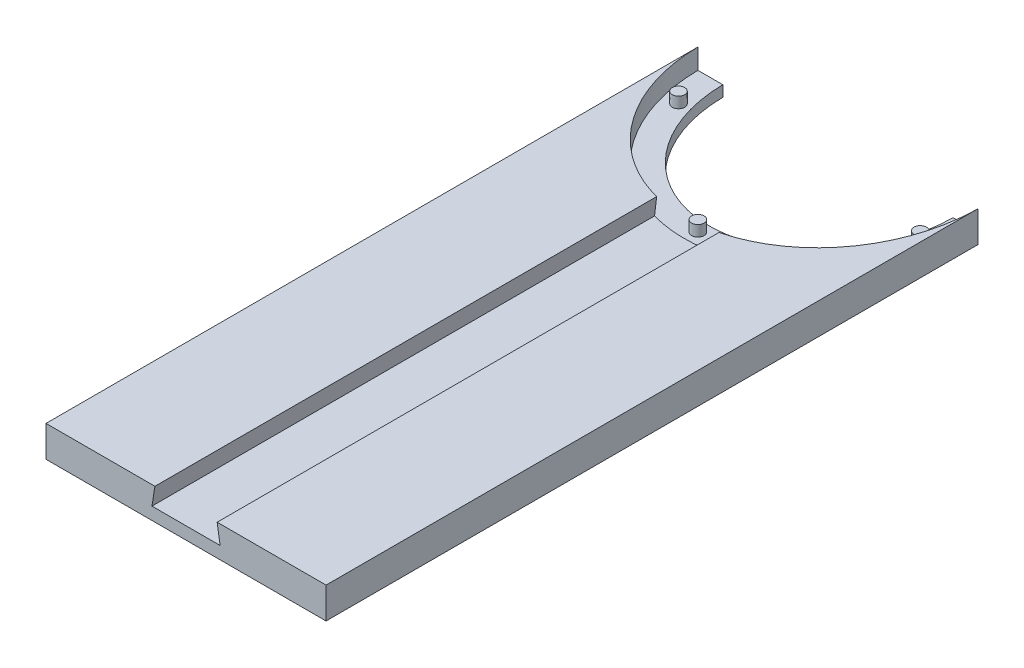
ISO-10303-21;
HEADER;
FILE_DESCRIPTION(('STEP AP214'),'2;1');
FILE_NAME('part.step','',(''),(''),'','','');
FILE_SCHEMA(('AUTOMOTIVE_DESIGN { 1 0 10303 214 1 1 1 1 }'));
ENDSEC;
DATA;
#1=APPLICATION_CONTEXT('core data for automotive mechanical design processes');
#2=APPLICATION_PROTOCOL_DEFINITION('international standard','automotive_design',2000,#1);
#3=PRODUCT_CONTEXT('',#1,'mechanical');
#4=PRODUCT('Part','Part','',(#3));
#5=PRODUCT_RELATED_PRODUCT_CATEGORY('part','',(#4));
#6=PRODUCT_DEFINITION_FORMATION('','',#4);
#7=PRODUCT_DEFINITION_CONTEXT('part definition',#1,'design');
#8=PRODUCT_DEFINITION('design','',#6,#7);
#9=PRODUCT_DEFINITION_SHAPE('','',#8);
#10=(LENGTH_UNIT() NAMED_UNIT(*) SI_UNIT(.MILLI.,.METRE.));
#11=(NAMED_UNIT(*) PLANE_ANGLE_UNIT() SI_UNIT($,.RADIAN.));
#12=(NAMED_UNIT(*) SI_UNIT($,.STERADIAN.) SOLID_ANGLE_UNIT());
#13=UNCERTAINTY_MEASURE_WITH_UNIT(LENGTH_MEASURE(1.E-05),#10,'distance_accuracy_value','');
#14=(GEOMETRIC_REPRESENTATION_CONTEXT(3) GLOBAL_UNCERTAINTY_ASSIGNED_CONTEXT((#13)) GLOBAL_UNIT_ASSIGNED_CONTEXT((#10,
#11,#12)) REPRESENTATION_CONTEXT('',''));
#15=CARTESIAN_POINT('',(0.,0.,0.));
#16=DIRECTION('',(0.,0.,1.));
#17=DIRECTION('',(1.,0.,0.));
#18=AXIS2_PLACEMENT_3D('',#15,#16,#17);
#19=CARTESIAN_POINT('',(0.,10.,0.));
#20=DIRECTION('',(0.,1.,0.));
#21=DIRECTION('',(0.,0.,1.));
#22=AXIS2_PLACEMENT_3D('',#19,#20,#21);
#23=PLANE('',#22);
#24=CARTESIAN_POINT('',(0.,10.,0.));
#25=DIRECTION('',(0.,1.,0.));
#26=DIRECTION('',(0.,0.,1.));
#27=AXIS2_PLACEMENT_3D('',#24,#25,#26);
#28=ELLIPSE('',#27,50.,45.);
#29=CARTESIAN_POINT('',(9.99999999999997,10.,48.7498021521785));
#30=VERTEX_POINT('',#29);
#31=CARTESIAN_POINT('',(44.9977499437472,10.,0.5));
#32=VERTEX_POINT('',#31);
#33=EDGE_CURVE('E72',#30,#32,#28,.T.);
#34=ORIENTED_EDGE('',*,*,#33,.F.);
#35=DIRECTION('',(0.,0.,1.));
#36=VECTOR('',#35,1.);
#37=CARTESIAN_POINT('',(9.99999999999998,10.,0.));
#38=LINE('',#37,#36);
#39=CARTESIAN_POINT('',(9.99999999999998,10.,210.));
#40=VERTEX_POINT('',#39);
#41=EDGE_CURVE('E56',#30,#40,#38,.T.);
#42=ORIENTED_EDGE('',*,*,#41,.T.);
#43=DIRECTION('',(1.,0.,0.));
#44=VECTOR('',#43,1.);
#45=CARTESIAN_POINT('',(0.,10.,210.));
#46=LINE('',#45,#44);
#47=CARTESIAN_POINT('',(45.,10.,210.));
#48=VERTEX_POINT('',#47);
#49=EDGE_CURVE('E116',#40,#48,#46,.T.);
#50=ORIENTED_EDGE('',*,*,#49,.T.);
#51=DIRECTION('',(0.,0.,-1.));
#52=VECTOR('',#51,1.);
#53=CARTESIAN_POINT('',(45.,10.,0.));
#54=LINE('',#53,#52);
#55=CARTESIAN_POINT('',(45.,10.,0.5));
#56=VERTEX_POINT('',#55);
#57=EDGE_CURVE('E120',#48,#56,#54,.T.);
#58=ORIENTED_EDGE('',*,*,#57,.T.);
#59=DIRECTION('',(1.,0.,0.));
#60=VECTOR('',#59,1.);
#61=CARTESIAN_POINT('',(0.,10.,0.5));
#62=LINE('',#61,#60);
#63=EDGE_CURVE('E139',#32,#56,#62,.T.);
#64=ORIENTED_EDGE('',*,*,#63,.F.);
#65=EDGE_LOOP('',(#34,#42,#50,#58,#64));
#66=FACE_BOUND('',#65,.T.);
#67=ADVANCED_FACE('F45',(#66),#23,.T.);
#68=DIRECTION('',(0.,-1.,0.));
#69=VECTOR('',#68,1.);
#70=SURFACE_OF_LINEAR_EXTRUSION('',#28,#69);
#71=CARTESIAN_POINT('',(-10.9503066419472,4.,48.4970507496741));
#72=CARTESIAN_POINT('',(-10.7919353279563,4.99991712359095,48.5411927180159));
#73=CARTESIAN_POINT('',(-10.6335574507986,5.99987568538642,48.5843263190622));
#74=CARTESIAN_POINT('',(-10.3167885701496,7.99987568538642,48.6685767865637));
#75=CARTESIAN_POINT('',(-10.1583975666582,8.99991712359095,48.7096936530189));
#76=CARTESIAN_POINT('',(-10.,10.,48.7498021521785));
#77=B_SPLINE_CURVE_WITH_KNOTS('',3,(#71,#72,#73,#74,#75,#76),.UNSPECIFIED.,.F.,.F.,(4,2,4),(0.,
3.04002478006059,6.08004956012118),.UNSPECIFIED.);
#78=CARTESIAN_POINT('',(-10.9503066419472,4.,48.497050749674));
#79=VERTEX_POINT('',#78);
#80=CARTESIAN_POINT('',(-10.,10.,48.7498021521785));
#81=VERTEX_POINT('',#80);
#82=EDGE_CURVE('E246',#79,#81,#77,.T.);
#83=ORIENTED_EDGE('',*,*,#82,.F.);
#84=CARTESIAN_POINT('',(0.,4.,0.));
#85=DIRECTION('',(0.,1.,0.));
#86=DIRECTION('',(0.,0.,1.));
#87=AXIS2_PLACEMENT_3D('',#84,#85,#86);
#88=ELLIPSE('',#87,50.,45.);
#89=CARTESIAN_POINT('',(10.9503066419472,4.00000000000005,48.497050749674));
#90=VERTEX_POINT('',#89);
#91=EDGE_CURVE('E249',#90,#79,#88,.F.);
#92=ORIENTED_EDGE('',*,*,#91,.F.);
#93=CARTESIAN_POINT('',(10.9503066419472,4.00000000000005,48.497050749674));
#94=CARTESIAN_POINT('',(10.7919353279564,4.99991712359099,48.5411927180159));
#95=CARTESIAN_POINT('',(10.6335574507987,5.99987568538645,48.5843263190622));
#96=CARTESIAN_POINT('',(10.3167885701496,7.99987568538644,48.6685767865637));
#97=CARTESIAN_POINT('',(10.1583975666582,8.99991712359095,48.7096936530189));
#98=CARTESIAN_POINT('',(9.99999999999998,10.,48.7498021521785));
#99=B_SPLINE_CURVE_WITH_KNOTS('',3,(#93,#94,#95,#96,#97,#98),.UNSPECIFIED.,.F.,.F.,(4,2,4),(0.,
3.04002478006057,6.08004956012115),.UNSPECIFIED.);
#100=EDGE_CURVE('E258',#90,#30,#99,.T.);
#101=ORIENTED_EDGE('',*,*,#100,.T.);
#102=ORIENTED_EDGE('',*,*,#33,.T.);
#103=DIRECTION('',(0.,-1.,0.));
#104=VECTOR('',#103,1.);
#105=CARTESIAN_POINT('',(44.9977499437472,10.,0.5));
#106=LINE('',#105,#104);
#107=CARTESIAN_POINT('',(44.9977499437472,3.5,0.5));
#108=VERTEX_POINT('',#107);
#109=EDGE_CURVE('E143',#32,#108,#106,.T.);
#110=ORIENTED_EDGE('',*,*,#109,.T.);
#111=CARTESIAN_POINT('',(0.,3.5,0.));
#112=DIRECTION('',(0.,1.,0.));
#113=DIRECTION('',(0.,0.,1.));
#114=AXIS2_PLACEMENT_3D('',#111,#112,#113);
#115=ELLIPSE('',#114,50.,45.);
#116=CARTESIAN_POINT('',(-44.9977499437472,3.5,0.5));
#117=VERTEX_POINT('',#116);
#118=EDGE_CURVE('E171',#117,#108,#115,.T.);
#119=ORIENTED_EDGE('',*,*,#118,.F.);
#120=DIRECTION('',(0.,-1.,0.));
#121=VECTOR('',#120,1.);
#122=CARTESIAN_POINT('',(-44.9977499437472,10.,0.5));
#123=LINE('',#122,#121);
#124=CARTESIAN_POINT('',(-44.9977499437472,10.,0.5));
#125=VERTEX_POINT('',#124);
#126=EDGE_CURVE('E103',#125,#117,#123,.T.);
#127=ORIENTED_EDGE('',*,*,#126,.F.);
#128=EDGE_CURVE('E251',#125,#81,#28,.T.);
#129=ORIENTED_EDGE('',*,*,#128,.T.);
#130=EDGE_LOOP('',(#83,#92,#101,#102,#110,#119,#127,#129));
#131=FACE_BOUND('',#130,.T.);
#132=ADVANCED_FACE('F47',(#131),#70,.T.);
#133=CARTESIAN_POINT('',(0.,10.,0.5));
#134=DIRECTION('',(0.,0.,-1.));
#135=DIRECTION('',(-1.,0.,0.));
#136=AXIS2_PLACEMENT_3D('',#133,#134,#135);
#137=PLANE('',#136);
#138=DIRECTION('',(1.,0.,0.));
#139=VECTOR('',#138,1.);
#140=CARTESIAN_POINT('',(0.,0.,0.5));
#141=LINE('',#140,#139);
#142=CARTESIAN_POINT('',(-45.,0.,0.5));
#143=VERTEX_POINT('',#142);
#144=CARTESIAN_POINT('',(-36.9973577680352,0.,0.5));
#145=VERTEX_POINT('',#144);
#146=EDGE_CURVE('E149',#143,#145,#141,.T.);
#147=ORIENTED_EDGE('',*,*,#146,.F.);
#148=DIRECTION('',(0.,-1.,0.));
#149=VECTOR('',#148,1.);
#150=CARTESIAN_POINT('',(-45.,10.,0.5));
#151=LINE('',#150,#149);
#152=CARTESIAN_POINT('',(-45.,10.,0.5));
#153=VERTEX_POINT('',#152);
#154=EDGE_CURVE('E335',#153,#143,#151,.T.);
#155=ORIENTED_EDGE('',*,*,#154,.F.);
#156=EDGE_CURVE('E145',#153,#125,#62,.T.);
#157=ORIENTED_EDGE('',*,*,#156,.T.);
#158=ORIENTED_EDGE('',*,*,#126,.T.);
#159=DIRECTION('',(1.,0.,0.));
#160=VECTOR('',#159,1.);
#161=CARTESIAN_POINT('',(0.,3.5,0.5));
#162=LINE('',#161,#160);
#163=CARTESIAN_POINT('',(-36.9973577680352,3.5,0.5));
#164=VERTEX_POINT('',#163);
#165=EDGE_CURVE('E176',#117,#164,#162,.T.);
#166=ORIENTED_EDGE('',*,*,#165,.T.);
#167=DIRECTION('',(0.,-1.,0.));
#168=VECTOR('',#167,1.);
#169=CARTESIAN_POINT('',(-36.9973577680352,3.5,0.5));
#170=LINE('',#169,#168);
#171=EDGE_CURVE('E175',#164,#145,#170,.T.);
#172=ORIENTED_EDGE('',*,*,#171,.T.);
#173=EDGE_LOOP('',(#147,#155,#157,#158,#166,#172));
#174=FACE_BOUND('',#173,.T.);
#175=ADVANCED_FACE('F224',(#174),#137,.T.);
#176=CARTESIAN_POINT('',(-45.,10.,0.));
#177=DIRECTION('',(-1.,0.,0.));
#178=DIRECTION('',(0.,0.,1.));
#179=AXIS2_PLACEMENT_3D('',#176,#177,#178);
#180=PLANE('',#179);
#181=DIRECTION('',(0.,0.,-1.));
#182=VECTOR('',#181,1.);
#183=CARTESIAN_POINT('',(-45.,0.,0.));
#184=LINE('',#183,#182);
#185=CARTESIAN_POINT('',(-45.,0.,210.));
#186=VERTEX_POINT('',#185);
#187=EDGE_CURVE('E153',#186,#143,#184,.T.);
#188=ORIENTED_EDGE('',*,*,#187,.F.);
#189=DIRECTION('',(0.,-1.,0.));
#190=VECTOR('',#189,1.);
#191=CARTESIAN_POINT('',(-45.,10.,210.));
#192=LINE('',#191,#190);
#193=CARTESIAN_POINT('',(-45.,10.,210.));
#194=VERTEX_POINT('',#193);
#195=EDGE_CURVE('E135',#194,#186,#192,.T.);
#196=ORIENTED_EDGE('',*,*,#195,.F.);
#197=DIRECTION('',(0.,0.,-1.));
#198=VECTOR('',#197,1.);
#199=CARTESIAN_POINT('',(-45.,10.,0.));
#200=LINE('',#199,#198);
#201=EDGE_CURVE('E124',#194,#153,#200,.T.);
#202=ORIENTED_EDGE('',*,*,#201,.T.);
#203=ORIENTED_EDGE('',*,*,#154,.T.);
#204=EDGE_LOOP('',(#188,#196,#202,#203));
#205=FACE_BOUND('',#204,.T.);
#206=ADVANCED_FACE('F228',(#205),#180,.T.);
#207=CARTESIAN_POINT('',(0.,10.,210.));
#208=DIRECTION('',(0.,0.,-1.));
#209=DIRECTION('',(-1.,0.,0.));
#210=AXIS2_PLACEMENT_3D('',#207,#208,#209);
#211=PLANE('',#210);
#212=DIRECTION('',(1.,0.,0.));
#213=VECTOR('',#212,1.);
#214=CARTESIAN_POINT('',(-10.9503066419472,4.,210.));
#215=LINE('',#214,#213);
#216=CARTESIAN_POINT('',(-10.9503066419472,4.,210.));
#217=VERTEX_POINT('',#216);
#218=CARTESIAN_POINT('',(10.9503066419472,4.00000000000005,210.));
#219=VERTEX_POINT('',#218);
#220=EDGE_CURVE('E380',#217,#219,#215,.T.);
#221=ORIENTED_EDGE('',*,*,#220,.F.);
#222=DIRECTION('',(-0.156434465040235,-0.987688340595137,0.));
#223=VECTOR('',#222,1.);
#224=CARTESIAN_POINT('',(-10.,10.,210.));
#225=LINE('',#224,#223);
#226=CARTESIAN_POINT('',(-10.,10.,210.));
#227=VERTEX_POINT('',#226);
#228=EDGE_CURVE('E382',#227,#217,#225,.T.);
#229=ORIENTED_EDGE('',*,*,#228,.F.);
#230=EDGE_CURVE('E123',#194,#227,#46,.T.);
#231=ORIENTED_EDGE('',*,*,#230,.F.);
#232=ORIENTED_EDGE('',*,*,#195,.T.);
#233=DIRECTION('',(1.,0.,0.));
#234=VECTOR('',#233,1.);
#235=CARTESIAN_POINT('',(0.,0.,210.));
#236=LINE('',#235,#234);
#237=CARTESIAN_POINT('',(45.,0.,210.));
#238=VERTEX_POINT('',#237);
#239=EDGE_CURVE('E131',#186,#238,#236,.T.);
#240=ORIENTED_EDGE('',*,*,#239,.T.);
#241=DIRECTION('',(0.,-1.,0.));
#242=VECTOR('',#241,1.);
#243=CARTESIAN_POINT('',(45.,10.,210.));
#244=LINE('',#243,#242);
#245=EDGE_CURVE('E127',#48,#238,#244,.T.);
#246=ORIENTED_EDGE('',*,*,#245,.F.);
#247=ORIENTED_EDGE('',*,*,#49,.F.);
#248=DIRECTION('',(0.156434465040239,-0.987688340595136,0.));
#249=VECTOR('',#248,1.);
#250=CARTESIAN_POINT('',(9.99999999999997,10.,210.));
#251=LINE('',#250,#249);
#252=EDGE_CURVE('E63',#40,#219,#251,.T.);
#253=ORIENTED_EDGE('',*,*,#252,.T.);
#254=EDGE_LOOP('',(#221,#229,#231,#232,#240,#246,#247,#253));
#255=FACE_BOUND('',#254,.T.);
#256=ADVANCED_FACE('F129',(#255),#211,.F.);
#257=CARTESIAN_POINT('',(45.,10.,0.));
#258=DIRECTION('',(-1.,0.,0.));
#259=DIRECTION('',(0.,0.,1.));
#260=AXIS2_PLACEMENT_3D('',#257,#258,#259);
#261=PLANE('',#260);
#262=DIRECTION('',(0.,0.,-1.));
#263=VECTOR('',#262,1.);
#264=CARTESIAN_POINT('',(45.,0.,0.));
#265=LINE('',#264,#263);
#266=CARTESIAN_POINT('',(45.,0.,0.5));
#267=VERTEX_POINT('',#266);
#268=EDGE_CURVE('E161',#238,#267,#265,.T.);
#269=ORIENTED_EDGE('',*,*,#268,.T.);
#270=DIRECTION('',(0.,-1.,0.));
#271=VECTOR('',#270,1.);
#272=CARTESIAN_POINT('',(45.,10.,0.5));
#273=LINE('',#272,#271);
#274=EDGE_CURVE('E95',#56,#267,#273,.T.);
#275=ORIENTED_EDGE('',*,*,#274,.F.);
#276=ORIENTED_EDGE('',*,*,#57,.F.);
#277=ORIENTED_EDGE('',*,*,#245,.T.);
#278=EDGE_LOOP('',(#269,#275,#276,#277));
#279=FACE_BOUND('',#278,.T.);
#280=ADVANCED_FACE('F137',(#279),#261,.F.);
#281=CARTESIAN_POINT('',(36.9973577680352,0.,0.5));
#282=VERTEX_POINT('',#281);
#283=EDGE_CURVE('E155',#282,#267,#141,.T.);
#284=ORIENTED_EDGE('',*,*,#283,.F.);
#285=DIRECTION('',(0.,-1.,0.));
#286=VECTOR('',#285,1.);
#287=CARTESIAN_POINT('',(36.9973577680352,3.5,0.5));
#288=LINE('',#287,#286);
#289=CARTESIAN_POINT('',(36.9973577680352,3.5,0.5));
#290=VERTEX_POINT('',#289);
#291=EDGE_CURVE('E154',#290,#282,#288,.T.);
#292=ORIENTED_EDGE('',*,*,#291,.F.);
#293=EDGE_CURVE('E184',#290,#108,#162,.T.);
#294=ORIENTED_EDGE('',*,*,#293,.T.);
#295=ORIENTED_EDGE('',*,*,#109,.F.);
#296=ORIENTED_EDGE('',*,*,#63,.T.);
#297=ORIENTED_EDGE('',*,*,#274,.T.);
#298=EDGE_LOOP('',(#284,#292,#294,#295,#296,#297));
#299=FACE_BOUND('',#298,.T.);
#300=ADVANCED_FACE('F217',(#299),#137,.T.);
#301=DIRECTION('',(0.,0.,1.));
#302=VECTOR('',#301,1.);
#303=CARTESIAN_POINT('',(-10.,10.,0.));
#304=LINE('',#303,#302);
#305=EDGE_CURVE('E11',#81,#227,#304,.T.);
#306=ORIENTED_EDGE('',*,*,#305,.F.);
#307=ORIENTED_EDGE('',*,*,#128,.F.);
#308=ORIENTED_EDGE('',*,*,#156,.F.);
#309=ORIENTED_EDGE('',*,*,#201,.F.);
#310=ORIENTED_EDGE('',*,*,#230,.T.);
#311=EDGE_LOOP('',(#306,#307,#308,#309,#310));
#312=FACE_BOUND('',#311,.T.);
#313=ADVANCED_FACE('F214',(#312),#23,.T.);
#314=CARTESIAN_POINT('',(0.,0.,0.));
#315=DIRECTION('',(0.,1.,0.));
#316=DIRECTION('',(0.,0.,1.));
#317=AXIS2_PLACEMENT_3D('',#314,#315,#316);
#318=PLANE('',#317);
#319=ORIENTED_EDGE('',*,*,#146,.T.);
#320=CARTESIAN_POINT('',(0.,0.,-42.));
#321=CARTESIAN_POINT('',(-4.93138164351082,0.,-42.));
#322=CARTESIAN_POINT('',(-14.7941449305325,0.,-39.7237391442364));
#323=CARTESIAN_POINT('',(-27.0896008441229,0.,-30.2004855000218));
#324=CARTESIAN_POINT('',(-35.1368792596779,0.,-16.2564691599312));
#325=CARTESIAN_POINT('',(-37.931560370161,0.,0.));
#326=CARTESIAN_POINT('',(-35.1368792596779,0.,16.2564691599312));
#327=CARTESIAN_POINT('',(-27.0896008441229,0.,30.2004855000218));
#328=CARTESIAN_POINT('',(-14.7941449305325,0.,39.7237391442364));
#329=CARTESIAN_POINT('',(0.,0.,43.1381304278818));
#330=CARTESIAN_POINT('',(14.7941449305325,0.,39.7237391442364));
#331=CARTESIAN_POINT('',(27.0896008441229,0.,30.2004855000219));
#332=CARTESIAN_POINT('',(35.1368792596779,0.,16.2564691599312));
#333=CARTESIAN_POINT('',(37.931560370161,0.,0.));
#334=CARTESIAN_POINT('',(35.1368792596779,0.,-16.2564691599312));
#335=CARTESIAN_POINT('',(27.0896008441229,0.,-30.2004855000218));
#336=CARTESIAN_POINT('',(14.7941449305325,0.,-39.7237391442364));
#337=CARTESIAN_POINT('',(4.93138164351083,0.,-42.));
#338=CARTESIAN_POINT('',(0.,0.,-42.));
#339=B_SPLINE_CURVE_WITH_KNOTS('',3,(#320,#321,#322,#323,#324,#325,#326,#327,#328,#329,#330,
#331,#332,#333,#334,#335,#336,#337,#338),.UNSPECIFIED.,.T.,.F.,(4,1,1,1,1,1,1,1,1,1,1,1,1,1,1,1,
4),(0.,0.392699081698724,0.785398163397448,1.17809724509617,1.5707963267949,1.96349540849362,
2.35619449019234,2.74889357189107,3.14159265358979,3.53429173528852,3.92699081698724,
4.31968989868597,4.71238898038469,5.10508806208341,5.49778714378214,5.89048622548086,
6.28318530717959),.UNSPECIFIED.);
#340=EDGE_CURVE('E198',#145,#282,#339,.T.);
#341=ORIENTED_EDGE('',*,*,#340,.T.);
#342=ORIENTED_EDGE('',*,*,#283,.T.);
#343=ORIENTED_EDGE('',*,*,#268,.F.);
#344=ORIENTED_EDGE('',*,*,#239,.F.);
#345=ORIENTED_EDGE('',*,*,#187,.T.);
#346=EDGE_LOOP('',(#319,#341,#342,#343,#344,#345));
#347=FACE_BOUND('',#346,.T.);
#348=ADVANCED_FACE('F211',(#347),#318,.F.);
#349=CARTESIAN_POINT('',(0.,3.5,-42.));
#350=CARTESIAN_POINT('',(-4.93138164351082,3.5,-42.));
#351=CARTESIAN_POINT('',(-14.7941449305325,3.5,-39.7237391442364));
#352=CARTESIAN_POINT('',(-27.0896008441229,3.5,-30.2004855000218));
#353=CARTESIAN_POINT('',(-35.1368792596779,3.5,-16.2564691599312));
#354=CARTESIAN_POINT('',(-37.931560370161,3.5,0.));
#355=CARTESIAN_POINT('',(-35.1368792596779,3.5,16.2564691599312));
#356=CARTESIAN_POINT('',(-27.0896008441229,3.5,30.2004855000218));
#357=CARTESIAN_POINT('',(-14.7941449305325,3.5,39.7237391442364));
#358=CARTESIAN_POINT('',(0.,3.5,43.1381304278818));
#359=CARTESIAN_POINT('',(14.7941449305325,3.5,39.7237391442364));
#360=CARTESIAN_POINT('',(27.0896008441229,3.5,30.2004855000219));
#361=CARTESIAN_POINT('',(35.1368792596779,3.5,16.2564691599312));
#362=CARTESIAN_POINT('',(37.931560370161,3.5,0.));
#363=CARTESIAN_POINT('',(35.1368792596779,3.5,-16.2564691599312));
#364=CARTESIAN_POINT('',(27.0896008441229,3.5,-30.2004855000218));
#365=CARTESIAN_POINT('',(14.7941449305325,3.5,-39.7237391442364));
#366=CARTESIAN_POINT('',(4.93138164351083,3.5,-42.));
#367=CARTESIAN_POINT('',(0.,3.5,-42.));
#368=B_SPLINE_CURVE_WITH_KNOTS('',3,(#349,#350,#351,#352,#353,#354,#355,#356,#357,#358,#359,
#360,#361,#362,#363,#364,#365,#366,#367),.UNSPECIFIED.,.T.,.F.,(4,1,1,1,1,1,1,1,1,1,1,1,1,1,1,1,
4),(0.,0.392699081698724,0.785398163397448,1.17809724509617,1.5707963267949,1.96349540849362,
2.35619449019234,2.74889357189107,3.14159265358979,3.53429173528852,3.92699081698724,
4.31968989868597,4.71238898038469,5.10508806208341,5.49778714378214,5.89048622548086,
6.28318530717959),.UNSPECIFIED.);
#369=DIRECTION('',(0.,-1.,0.));
#370=VECTOR('',#369,1.);
#371=SURFACE_OF_LINEAR_EXTRUSION('',#368,#370);
#372=ORIENTED_EDGE('',*,*,#340,.F.);
#373=ORIENTED_EDGE('',*,*,#171,.F.);
#374=EDGE_CURVE('E183',#164,#290,#368,.T.);
#375=ORIENTED_EDGE('',*,*,#374,.T.);
#376=ORIENTED_EDGE('',*,*,#291,.T.);
#377=EDGE_LOOP('',(#372,#373,#375,#376));
#378=FACE_BOUND('',#377,.T.);
#379=ADVANCED_FACE('F206',(#378),#371,.T.);
#380=CARTESIAN_POINT('',(0.,3.5,0.));
#381=DIRECTION('',(0.,1.,0.));
#382=DIRECTION('',(0.,0.,1.));
#383=AXIS2_PLACEMENT_3D('',#380,#381,#382);
#384=PLANE('',#383);
#385=CARTESIAN_POINT('',(38.8404838015386,3.5,12.9089643673815));
#386=DIRECTION('',(0.,1.,0.));
#387=DIRECTION('',(0.,0.,1.));
#388=AXIS2_PLACEMENT_3D('',#385,#386,#387);
#389=CIRCLE('',#388,2.);
#390=CARTESIAN_POINT('',(38.8404838015386,3.5,14.9089643673815));
#391=VERTEX_POINT('',#390);
#392=EDGE_CURVE('E329',#391,#391,#389,.T.);
#393=ORIENTED_EDGE('',*,*,#392,.F.);
#394=EDGE_LOOP('',(#393));
#395=FACE_BOUND('',#394,.T.);
#396=CARTESIAN_POINT('',(0.,3.5,45.5));
#397=DIRECTION('',(0.,1.,0.));
#398=DIRECTION('',(0.,0.,1.));
#399=AXIS2_PLACEMENT_3D('',#396,#397,#398);
#400=CIRCLE('',#399,2.);
#401=CARTESIAN_POINT('',(0.,3.5,47.5));
#402=VERTEX_POINT('',#401);
#403=EDGE_CURVE('E318',#402,#402,#400,.F.);
#404=ORIENTED_EDGE('',*,*,#403,.T.);
#405=EDGE_LOOP('',(#404));
#406=FACE_BOUND('',#405,.T.);
#407=CARTESIAN_POINT('',(-38.8404838015386,3.5,12.9089643673815));
#408=DIRECTION('',(0.,1.,0.));
#409=DIRECTION('',(0.,0.,1.));
#410=AXIS2_PLACEMENT_3D('',#407,#408,#409);
#411=CIRCLE('',#410,2.);
#412=CARTESIAN_POINT('',(-38.8404838015386,3.5,14.9089643673815));
#413=VERTEX_POINT('',#412);
#414=EDGE_CURVE('E314',#413,#413,#411,.F.);
#415=ORIENTED_EDGE('',*,*,#414,.T.);
#416=EDGE_LOOP('',(#415));
#417=FACE_BOUND('',#416,.T.);
#418=ORIENTED_EDGE('',*,*,#293,.F.);
#419=ORIENTED_EDGE('',*,*,#374,.F.);
#420=ORIENTED_EDGE('',*,*,#165,.F.);
#421=ORIENTED_EDGE('',*,*,#118,.T.);
#422=EDGE_LOOP('',(#418,#419,#420,#421));
#423=FACE_BOUND('',#422,.T.);
#424=ADVANCED_FACE('F210',(#395,#406,#417,#423),#384,.T.);
#425=CARTESIAN_POINT('',(-38.8404838015386,7.,12.9089643673815));
#426=DIRECTION('',(0.,-1.,0.));
#427=DIRECTION('',(0.,0.,-1.));
#428=AXIS2_PLACEMENT_3D('',#425,#426,#427);
#429=CYLINDRICAL_SURFACE('',#428,2.);
#430=ORIENTED_EDGE('',*,*,#414,.F.);
#431=EDGE_LOOP('',(#430));
#432=FACE_BOUND('',#431,.T.);
#433=CARTESIAN_POINT('',(-38.8404838015386,7.,12.9089643673815));
#434=DIRECTION('',(0.,1.,0.));
#435=DIRECTION('',(0.,0.,1.));
#436=AXIS2_PLACEMENT_3D('',#433,#434,#435);
#437=CIRCLE('',#436,2.);
#438=CARTESIAN_POINT('',(-38.8404838015386,7.,14.9089643673815));
#439=VERTEX_POINT('',#438);
#440=EDGE_CURVE('E189',#439,#439,#437,.T.);
#441=ORIENTED_EDGE('',*,*,#440,.F.);
#442=EDGE_LOOP('',(#441));
#443=FACE_BOUND('',#442,.T.);
#444=ADVANCED_FACE('F303',(#432,#443),#429,.T.);
#445=CARTESIAN_POINT('',(-38.8404838015386,7.,12.9089643673815));
#446=DIRECTION('',(0.,1.,0.));
#447=DIRECTION('',(0.,0.,1.));
#448=AXIS2_PLACEMENT_3D('',#445,#446,#447);
#449=PLANE('',#448);
#450=ORIENTED_EDGE('',*,*,#440,.T.);
#451=EDGE_LOOP('',(#450));
#452=FACE_BOUND('',#451,.T.);
#453=ADVANCED_FACE('F297',(#452),#449,.T.);
#454=CARTESIAN_POINT('',(0.,7.,45.5));
#455=DIRECTION('',(0.,-1.,0.));
#456=DIRECTION('',(0.,0.,-1.));
#457=AXIS2_PLACEMENT_3D('',#454,#455,#456);
#458=CYLINDRICAL_SURFACE('',#457,2.);
#459=ORIENTED_EDGE('',*,*,#403,.F.);
#460=EDGE_LOOP('',(#459));
#461=FACE_BOUND('',#460,.T.);
#462=CARTESIAN_POINT('',(0.,7.,45.5));
#463=DIRECTION('',(0.,1.,0.));
#464=DIRECTION('',(0.,0.,1.));
#465=AXIS2_PLACEMENT_3D('',#462,#463,#464);
#466=CIRCLE('',#465,2.);
#467=CARTESIAN_POINT('',(0.,7.,47.5));
#468=VERTEX_POINT('',#467);
#469=EDGE_CURVE('E322',#468,#468,#466,.T.);
#470=ORIENTED_EDGE('',*,*,#469,.F.);
#471=EDGE_LOOP('',(#470));
#472=FACE_BOUND('',#471,.T.);
#473=ADVANCED_FACE('F294',(#461,#472),#458,.T.);
#474=CARTESIAN_POINT('',(0.,7.,45.5));
#475=DIRECTION('',(0.,1.,0.));
#476=DIRECTION('',(0.,0.,1.));
#477=AXIS2_PLACEMENT_3D('',#474,#475,#476);
#478=PLANE('',#477);
#479=ORIENTED_EDGE('',*,*,#469,.T.);
#480=EDGE_LOOP('',(#479));
#481=FACE_BOUND('',#480,.T.);
#482=ADVANCED_FACE('F289',(#481),#478,.T.);
#483=CARTESIAN_POINT('',(38.8404838015386,7.,12.9089643673815));
#484=DIRECTION('',(0.,-1.,0.));
#485=DIRECTION('',(0.,0.,-1.));
#486=AXIS2_PLACEMENT_3D('',#483,#484,#485);
#487=CYLINDRICAL_SURFACE('',#486,2.);
#488=ORIENTED_EDGE('',*,*,#392,.T.);
#489=EDGE_LOOP('',(#488));
#490=FACE_BOUND('',#489,.T.);
#491=CARTESIAN_POINT('',(38.8404838015386,7.,12.9089643673815));
#492=DIRECTION('',(0.,-1.,0.));
#493=DIRECTION('',(0.,0.,-1.));
#494=AXIS2_PLACEMENT_3D('',#491,#492,#493);
#495=CIRCLE('',#494,2.);
#496=CARTESIAN_POINT('',(38.8404838015386,7.,10.9089643673815));
#497=VERTEX_POINT('',#496);
#498=EDGE_CURVE('E262',#497,#497,#495,.T.);
#499=ORIENTED_EDGE('',*,*,#498,.T.);
#500=EDGE_LOOP('',(#499));
#501=FACE_BOUND('',#500,.T.);
#502=ADVANCED_FACE('F286',(#490,#501),#487,.T.);
#503=CARTESIAN_POINT('',(38.8404838015386,7.,12.9089643673815));
#504=DIRECTION('',(0.,-1.,0.));
#505=DIRECTION('',(0.,0.,-1.));
#506=AXIS2_PLACEMENT_3D('',#503,#504,#505);
#507=PLANE('',#506);
#508=ORIENTED_EDGE('',*,*,#498,.F.);
#509=EDGE_LOOP('',(#508));
#510=FACE_BOUND('',#509,.T.);
#511=ADVANCED_FACE('F284',(#510),#507,.F.);
#512=CARTESIAN_POINT('',(-10.,10.,48.));
#513=DIRECTION('',(-0.987688340595137,0.156434465040235,0.));
#514=DIRECTION('',(-0.156434465040235,-0.987688340595137,0.));
#515=AXIS2_PLACEMENT_3D('',#512,#513,#514);
#516=PLANE('',#515);
#517=ORIENTED_EDGE('',*,*,#82,.T.);
#518=ORIENTED_EDGE('',*,*,#305,.T.);
#519=ORIENTED_EDGE('',*,*,#228,.T.);
#520=DIRECTION('',(0.,0.,1.));
#521=VECTOR('',#520,1.);
#522=CARTESIAN_POINT('',(-10.9503066419472,4.,48.));
#523=LINE('',#522,#521);
#524=EDGE_CURVE('E377',#79,#217,#523,.T.);
#525=ORIENTED_EDGE('',*,*,#524,.F.);
#526=EDGE_LOOP('',(#517,#518,#519,#525));
#527=FACE_BOUND('',#526,.T.);
#528=ADVANCED_FACE('F278',(#527),#516,.F.);
#529=CARTESIAN_POINT('',(9.99999999999997,10.,48.));
#530=DIRECTION('',(-0.987688340595136,-0.156434465040239,0.));
#531=DIRECTION('',(0.156434465040239,-0.987688340595137,0.));
#532=AXIS2_PLACEMENT_3D('',#529,#530,#531);
#533=PLANE('',#532);
#534=DIRECTION('',(0.,0.,1.));
#535=VECTOR('',#534,1.);
#536=CARTESIAN_POINT('',(10.9503066419472,4.00000000000005,48.));
#537=LINE('',#536,#535);
#538=EDGE_CURVE('E264',#90,#219,#537,.T.);
#539=ORIENTED_EDGE('',*,*,#538,.T.);
#540=ORIENTED_EDGE('',*,*,#252,.F.);
#541=ORIENTED_EDGE('',*,*,#41,.F.);
#542=ORIENTED_EDGE('',*,*,#100,.F.);
#543=EDGE_LOOP('',(#539,#540,#541,#542));
#544=FACE_BOUND('',#543,.T.);
#545=ADVANCED_FACE('F283',(#544),#533,.T.);
#546=CARTESIAN_POINT('',(-10.9503066419472,4.,48.));
#547=DIRECTION('',(0.,-1.,0.));
#548=DIRECTION('',(1.,0.,0.));
#549=AXIS2_PLACEMENT_3D('',#546,#547,#548);
#550=PLANE('',#549);
#551=ORIENTED_EDGE('',*,*,#91,.T.);
#552=ORIENTED_EDGE('',*,*,#524,.T.);
#553=ORIENTED_EDGE('',*,*,#220,.T.);
#554=ORIENTED_EDGE('',*,*,#538,.F.);
#555=EDGE_LOOP('',(#551,#552,#553,#554));
#556=FACE_BOUND('',#555,.T.);
#557=ADVANCED_FACE('F285',(#556),#550,.F.);
#558=CLOSED_SHELL('',(#67,#132,#175,#206,#256,#280,#300,#313,#348,#379,#424,#444,#453,#473,#482,
#502,#511,#528,#545,#557));
#559=MANIFOLD_SOLID_BREP('B2',#558);
#560=ADVANCED_BREP_SHAPE_REPRESENTATION('',(#18,#559),#14);
#561=SHAPE_DEFINITION_REPRESENTATION(#9,#560);
ENDSEC;
END-ISO-10303-21;
